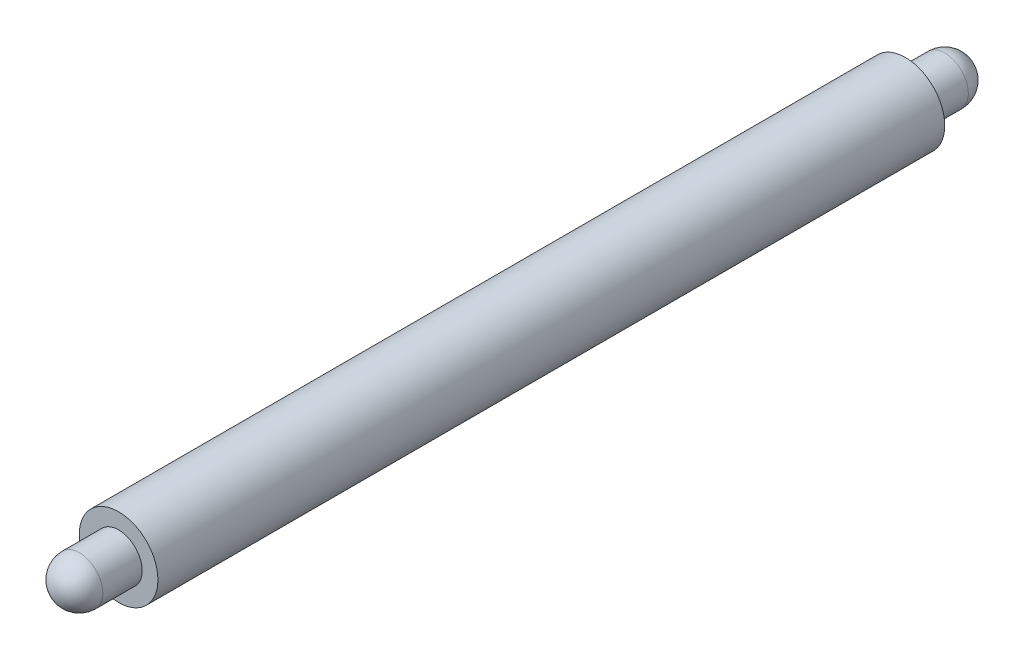
ISO-10303-21;
HEADER;
FILE_DESCRIPTION(('STEP AP214'),'2;1');
FILE_NAME('part.step','',(''),(''),'','','');
FILE_SCHEMA(('AUTOMOTIVE_DESIGN { 1 0 10303 214 1 1 1 1 }'));
ENDSEC;
DATA;
#1=APPLICATION_CONTEXT('core data for automotive mechanical design processes');
#2=APPLICATION_PROTOCOL_DEFINITION('international standard','automotive_design',2000,#1);
#3=PRODUCT_CONTEXT('',#1,'mechanical');
#4=PRODUCT('Part','Part','',(#3));
#5=PRODUCT_RELATED_PRODUCT_CATEGORY('part','',(#4));
#6=PRODUCT_DEFINITION_FORMATION('','',#4);
#7=PRODUCT_DEFINITION_CONTEXT('part definition',#1,'design');
#8=PRODUCT_DEFINITION('design','',#6,#7);
#9=PRODUCT_DEFINITION_SHAPE('','',#8);
#10=(LENGTH_UNIT() NAMED_UNIT(*) SI_UNIT(.MILLI.,.METRE.));
#11=(NAMED_UNIT(*) PLANE_ANGLE_UNIT() SI_UNIT($,.RADIAN.));
#12=(NAMED_UNIT(*) SI_UNIT($,.STERADIAN.) SOLID_ANGLE_UNIT());
#13=UNCERTAINTY_MEASURE_WITH_UNIT(LENGTH_MEASURE(1.E-05),#10,'distance_accuracy_value','');
#14=(GEOMETRIC_REPRESENTATION_CONTEXT(3) GLOBAL_UNCERTAINTY_ASSIGNED_CONTEXT((#13)) GLOBAL_UNIT_ASSIGNED_CONTEXT((#10,
#11,#12)) REPRESENTATION_CONTEXT('',''));
#15=CARTESIAN_POINT('',(0.,0.,0.));
#16=DIRECTION('',(0.,0.,1.));
#17=DIRECTION('',(1.,0.,0.));
#18=AXIS2_PLACEMENT_3D('',#15,#16,#17);
#19=CARTESIAN_POINT('',(-48.1040529695024,10.2305555555555,100.));
#20=DIRECTION('',(0.,0.,-1.));
#21=DIRECTION('',(-1.,0.,0.));
#22=AXIS2_PLACEMENT_3D('',#19,#20,#21);
#23=CYLINDRICAL_SURFACE('',#22,5.);
#24=CARTESIAN_POINT('',(-48.1040529695024,10.2305555555555,100.));
#25=DIRECTION('',(0.,0.,1.));
#26=DIRECTION('',(1.,0.,0.));
#27=AXIS2_PLACEMENT_3D('',#24,#25,#26);
#28=CIRCLE('',#27,5.);
#29=CARTESIAN_POINT('',(-43.1040529695024,10.2305555555555,100.));
#30=VERTEX_POINT('',#29);
#31=EDGE_CURVE('E45',#30,#30,#28,.T.);
#32=ORIENTED_EDGE('',*,*,#31,.F.);
#33=EDGE_LOOP('',(#32));
#34=FACE_BOUND('',#33,.T.);
#35=CARTESIAN_POINT('',(-48.1040529695024,10.2305555555555,0.));
#36=DIRECTION('',(0.,0.,1.));
#37=DIRECTION('',(1.,0.,0.));
#38=AXIS2_PLACEMENT_3D('',#35,#36,#37);
#39=CIRCLE('',#38,5.);
#40=CARTESIAN_POINT('',(-43.1040529695024,10.2305555555555,0.));
#41=VERTEX_POINT('',#40);
#42=EDGE_CURVE('E48',#41,#41,#39,.T.);
#43=ORIENTED_EDGE('',*,*,#42,.T.);
#44=EDGE_LOOP('',(#43));
#45=FACE_BOUND('',#44,.T.);
#46=ADVANCED_FACE('F30',(#34,#45),#23,.T.);
#47=CARTESIAN_POINT('',(-48.1040529695024,10.2305555555555,100.));
#48=DIRECTION('',(0.,0.,1.));
#49=DIRECTION('',(1.,0.,0.));
#50=AXIS2_PLACEMENT_3D('',#47,#48,#49);
#51=PLANE('',#50);
#52=CARTESIAN_POINT('',(-48.1040529695024,10.2305555555555,100.));
#53=DIRECTION('',(0.,0.,1.));
#54=DIRECTION('',(1.,0.,0.));
#55=AXIS2_PLACEMENT_3D('',#52,#53,#54);
#56=CIRCLE('',#55,3.);
#57=CARTESIAN_POINT('',(-45.1040529695024,10.2305555555555,100.));
#58=VERTEX_POINT('',#57);
#59=EDGE_CURVE('E51',#58,#58,#56,.T.);
#60=ORIENTED_EDGE('',*,*,#59,.F.);
#61=EDGE_LOOP('',(#60));
#62=FACE_BOUND('',#61,.T.);
#63=ORIENTED_EDGE('',*,*,#31,.T.);
#64=EDGE_LOOP('',(#63));
#65=FACE_BOUND('',#64,.T.);
#66=ADVANCED_FACE('F59',(#62,#65),#51,.T.);
#67=CARTESIAN_POINT('',(-48.1040529695024,10.2305555555555,0.));
#68=DIRECTION('',(0.,0.,1.));
#69=DIRECTION('',(1.,0.,0.));
#70=AXIS2_PLACEMENT_3D('',#67,#68,#69);
#71=PLANE('',#70);
#72=CARTESIAN_POINT('',(-48.1040529695024,10.2305555555555,0.));
#73=DIRECTION('',(0.,0.,1.));
#74=DIRECTION('',(1.,0.,0.));
#75=AXIS2_PLACEMENT_3D('',#72,#73,#74);
#76=CIRCLE('',#75,3.);
#77=CARTESIAN_POINT('',(-45.1040529695024,10.2305555555555,0.));
#78=VERTEX_POINT('',#77);
#79=EDGE_CURVE('E41',#78,#78,#76,.F.);
#80=ORIENTED_EDGE('',*,*,#79,.F.);
#81=EDGE_LOOP('',(#80));
#82=FACE_BOUND('',#81,.T.);
#83=ORIENTED_EDGE('',*,*,#42,.F.);
#84=EDGE_LOOP('',(#83));
#85=FACE_BOUND('',#84,.T.);
#86=ADVANCED_FACE('F62',(#82,#85),#71,.F.);
#87=CARTESIAN_POINT('',(-48.1040529695024,10.2305555555555,108.));
#88=DIRECTION('',(0.,0.,-1.));
#89=DIRECTION('',(-1.,0.,0.));
#90=AXIS2_PLACEMENT_3D('',#87,#88,#89);
#91=CYLINDRICAL_SURFACE('',#90,3.);
#92=CARTESIAN_POINT('',(-48.1040529695024,10.2305555555555,105.));
#93=DIRECTION('',(0.,0.,-1.));
#94=DIRECTION('',(-1.,0.,0.));
#95=AXIS2_PLACEMENT_3D('',#92,#93,#94);
#96=CIRCLE('',#95,3.);
#97=CARTESIAN_POINT('',(-51.1040529695024,10.2305555555555,105.));
#98=VERTEX_POINT('',#97);
#99=EDGE_CURVE('E37',#98,#98,#96,.T.);
#100=ORIENTED_EDGE('',*,*,#99,.T.);
#101=EDGE_LOOP('',(#100));
#102=FACE_BOUND('',#101,.T.);
#103=ORIENTED_EDGE('',*,*,#59,.T.);
#104=EDGE_LOOP('',(#103));
#105=FACE_BOUND('',#104,.T.);
#106=ADVANCED_FACE('F57',(#102,#105),#91,.T.);
#107=CARTESIAN_POINT('',(-48.1040529695024,10.2305555555555,-8.));
#108=DIRECTION('',(0.,0.,1.));
#109=DIRECTION('',(1.,0.,0.));
#110=AXIS2_PLACEMENT_3D('',#107,#108,#109);
#111=CYLINDRICAL_SURFACE('',#110,3.);
#112=CARTESIAN_POINT('',(-48.1040529695024,10.2305555555555,-5.));
#113=DIRECTION('',(0.,0.,1.));
#114=DIRECTION('',(1.,0.,0.));
#115=AXIS2_PLACEMENT_3D('',#112,#113,#114);
#116=CIRCLE('',#115,3.);
#117=CARTESIAN_POINT('',(-45.1040529695024,10.2305555555555,-5.));
#118=VERTEX_POINT('',#117);
#119=EDGE_CURVE('E10',#118,#118,#116,.T.);
#120=ORIENTED_EDGE('',*,*,#119,.T.);
#121=EDGE_LOOP('',(#120));
#122=FACE_BOUND('',#121,.T.);
#123=ORIENTED_EDGE('',*,*,#79,.T.);
#124=EDGE_LOOP('',(#123));
#125=FACE_BOUND('',#124,.T.);
#126=ADVANCED_FACE('F77',(#122,#125),#111,.T.);
#127=CARTESIAN_POINT('',(-48.1040529695024,10.2305555555555,105.));
#128=DIRECTION('',(0.,0.,1.));
#129=DIRECTION('',(1.,0.,0.));
#130=AXIS2_PLACEMENT_3D('',#127,#128,#129);
#131=SPHERICAL_SURFACE('',#130,3.);
#132=ORIENTED_EDGE('',*,*,#99,.F.);
#133=EDGE_LOOP('',(#132));
#134=FACE_BOUND('',#133,.T.);
#135=ADVANCED_FACE('F80',(#134),#131,.T.);
#136=CARTESIAN_POINT('',(-48.1040529695024,10.2305555555555,-5.));
#137=DIRECTION('',(0.,0.,-1.));
#138=DIRECTION('',(-1.,0.,0.));
#139=AXIS2_PLACEMENT_3D('',#136,#137,#138);
#140=SPHERICAL_SURFACE('',#139,3.);
#141=ORIENTED_EDGE('',*,*,#119,.F.);
#142=EDGE_LOOP('',(#141));
#143=FACE_BOUND('',#142,.T.);
#144=ADVANCED_FACE('F32',(#143),#140,.T.);
#145=CLOSED_SHELL('',(#46,#66,#86,#106,#126,#135,#144));
#146=MANIFOLD_SOLID_BREP('B2',#145);
#147=ADVANCED_BREP_SHAPE_REPRESENTATION('',(#18,#146),#14);
#148=SHAPE_DEFINITION_REPRESENTATION(#9,#147);
ENDSEC;
END-ISO-10303-21;
